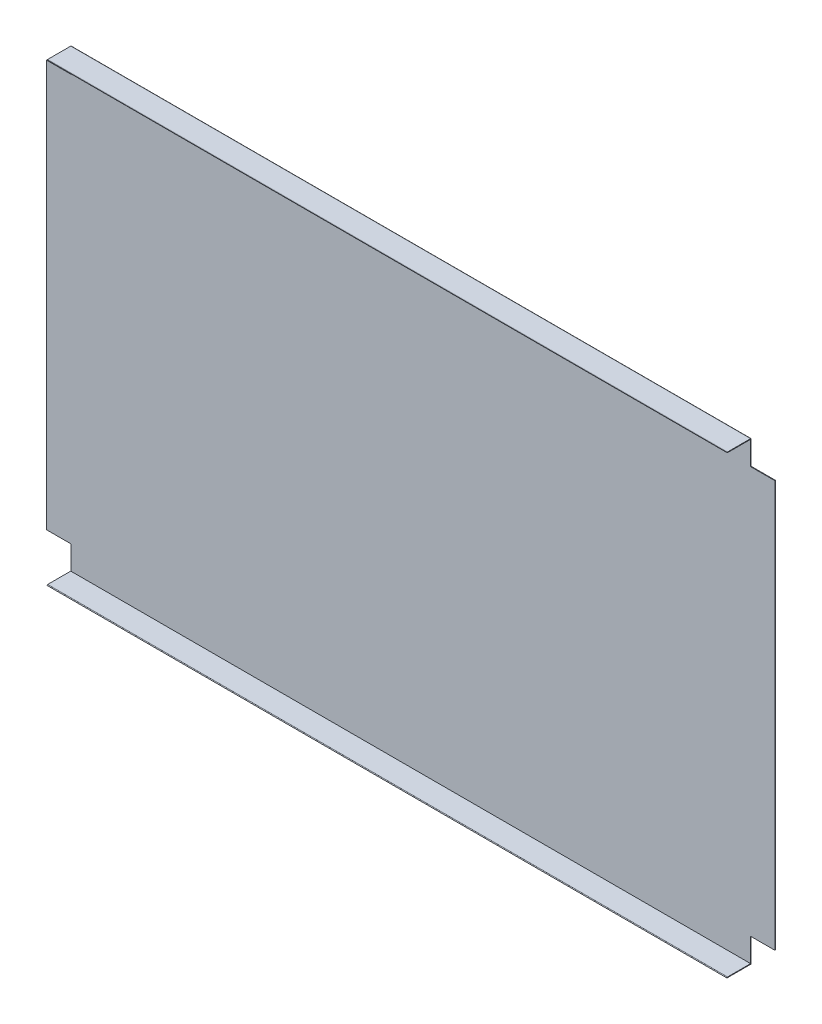
ISO-10303-21;
HEADER;
FILE_DESCRIPTION(('STEP AP214'),'2;1');
FILE_NAME('part.step','',(''),(''),'','','');
FILE_SCHEMA(('AUTOMOTIVE_DESIGN { 1 0 10303 214 1 1 1 1 }'));
ENDSEC;
DATA;
#1=APPLICATION_CONTEXT('core data for automotive mechanical design processes');
#2=APPLICATION_PROTOCOL_DEFINITION('international standard','automotive_design',2000,#1);
#3=PRODUCT_CONTEXT('',#1,'mechanical');
#4=PRODUCT('Part','Part','',(#3));
#5=PRODUCT_RELATED_PRODUCT_CATEGORY('part','',(#4));
#6=PRODUCT_DEFINITION_FORMATION('','',#4);
#7=PRODUCT_DEFINITION_CONTEXT('part definition',#1,'design');
#8=PRODUCT_DEFINITION('design','',#6,#7);
#9=PRODUCT_DEFINITION_SHAPE('','',#8);
#10=(LENGTH_UNIT() NAMED_UNIT(*) SI_UNIT(.MILLI.,.METRE.));
#11=(NAMED_UNIT(*) PLANE_ANGLE_UNIT() SI_UNIT($,.RADIAN.));
#12=(NAMED_UNIT(*) SI_UNIT($,.STERADIAN.) SOLID_ANGLE_UNIT());
#13=UNCERTAINTY_MEASURE_WITH_UNIT(LENGTH_MEASURE(1.E-05),#10,'distance_accuracy_value','');
#14=(GEOMETRIC_REPRESENTATION_CONTEXT(3) GLOBAL_UNCERTAINTY_ASSIGNED_CONTEXT((#13)) GLOBAL_UNIT_ASSIGNED_CONTEXT((#10,
#11,#12)) REPRESENTATION_CONTEXT('',''));
#15=CARTESIAN_POINT('',(0.,0.,0.));
#16=DIRECTION('',(0.,0.,1.));
#17=DIRECTION('',(1.,0.,0.));
#18=AXIS2_PLACEMENT_3D('',#15,#16,#17);
#19=CARTESIAN_POINT('',(559.999999999999,375.,659.000000000004));
#20=DIRECTION('',(-1.,0.,0.));
#21=DIRECTION('',(0.,0.,1.));
#22=AXIS2_PLACEMENT_3D('',#19,#20,#21);
#23=PLANE('',#22);
#24=DIRECTION('',(0.,1.,0.));
#25=VECTOR('',#24,1.);
#26=CARTESIAN_POINT('',(559.999999999999,374.,697.000000000004));
#27=LINE('',#26,#25);
#28=CARTESIAN_POINT('',(559.999999999999,374.,697.000000000004));
#29=VERTEX_POINT('',#28);
#30=CARTESIAN_POINT('',(559.999999999999,375.,697.000000000004));
#31=VERTEX_POINT('',#30);
#32=EDGE_CURVE('E387',#29,#31,#27,.T.);
#33=ORIENTED_EDGE('',*,*,#32,.F.);
#34=DIRECTION('',(0.,0.,1.));
#35=VECTOR('',#34,1.);
#36=CARTESIAN_POINT('',(559.999999999999,374.,659.000000000004));
#37=LINE('',#36,#35);
#38=CARTESIAN_POINT('',(559.999999999999,374.,659.000000000004));
#39=VERTEX_POINT('',#38);
#40=EDGE_CURVE('E346',#29,#39,#37,.F.);
#41=ORIENTED_EDGE('',*,*,#40,.T.);
#42=DIRECTION('',(0.,-1.,0.));
#43=VECTOR('',#42,1.);
#44=CARTESIAN_POINT('',(559.999999999999,375.,659.000000000004));
#45=LINE('',#44,#43);
#46=CARTESIAN_POINT('',(559.999999999999,375.,659.000000000004));
#47=VERTEX_POINT('',#46);
#48=EDGE_CURVE('E363',#47,#39,#45,.T.);
#49=ORIENTED_EDGE('',*,*,#48,.F.);
#50=DIRECTION('',(0.,0.,-1.));
#51=VECTOR('',#50,1.);
#52=CARTESIAN_POINT('',(559.999999999999,374.999999999998,-1.07101362040149E-12));
#53=LINE('',#52,#51);
#54=EDGE_CURVE('E354',#31,#47,#53,.T.);
#55=ORIENTED_EDGE('',*,*,#54,.F.);
#56=EDGE_LOOP('',(#33,#41,#49,#55));
#57=FACE_BOUND('',#56,.T.);
#58=ADVANCED_FACE('F160',(#57),#23,.F.);
#59=CARTESIAN_POINT('',(-560.,375.,698.000000000004));
#60=DIRECTION('',(1.,0.,0.));
#61=DIRECTION('',(0.,0.,-1.));
#62=AXIS2_PLACEMENT_3D('',#59,#60,#61);
#63=PLANE('',#62);
#64=DIRECTION('',(0.,1.,0.));
#65=VECTOR('',#64,1.);
#66=CARTESIAN_POINT('',(-560.,374.,697.000000000004));
#67=LINE('',#66,#65);
#68=CARTESIAN_POINT('',(-560.,374.,697.000000000004));
#69=VERTEX_POINT('',#68);
#70=CARTESIAN_POINT('',(-560.,375.,697.000000000004));
#71=VERTEX_POINT('',#70);
#72=EDGE_CURVE('E348',#69,#71,#67,.T.);
#73=ORIENTED_EDGE('',*,*,#72,.T.);
#74=DIRECTION('',(0.,0.,1.));
#75=VECTOR('',#74,1.);
#76=CARTESIAN_POINT('',(-560.,374.999999999998,-1.07101362040149E-12));
#77=LINE('',#76,#75);
#78=CARTESIAN_POINT('',(-560.,375.,659.000000000004));
#79=VERTEX_POINT('',#78);
#80=EDGE_CURVE('E358',#79,#71,#77,.T.);
#81=ORIENTED_EDGE('',*,*,#80,.F.);
#82=DIRECTION('',(0.,-1.,0.));
#83=VECTOR('',#82,1.);
#84=CARTESIAN_POINT('',(-560.,375.,659.000000000004));
#85=LINE('',#84,#83);
#86=CARTESIAN_POINT('',(-560.,374.,659.000000000004));
#87=VERTEX_POINT('',#86);
#88=EDGE_CURVE('E332',#79,#87,#85,.T.);
#89=ORIENTED_EDGE('',*,*,#88,.T.);
#90=DIRECTION('',(0.,0.,-1.));
#91=VECTOR('',#90,1.);
#92=CARTESIAN_POINT('',(-560.,374.,698.000000000004));
#93=LINE('',#92,#91);
#94=EDGE_CURVE('E352',#87,#69,#93,.F.);
#95=ORIENTED_EDGE('',*,*,#94,.T.);
#96=EDGE_LOOP('',(#73,#81,#89,#95));
#97=FACE_BOUND('',#96,.T.);
#98=ADVANCED_FACE('F418',(#97),#63,.F.);
#99=CARTESIAN_POINT('',(0.,374.999999999998,-1.07101362040149E-12));
#100=DIRECTION('',(0.,-1.,0.));
#101=DIRECTION('',(0.,0.,-1.));
#102=AXIS2_PLACEMENT_3D('',#99,#100,#101);
#103=PLANE('',#102);
#104=DIRECTION('',(-1.,0.,0.));
#105=VECTOR('',#104,1.);
#106=CARTESIAN_POINT('',(-560.,375.,697.000000000004));
#107=LINE('',#106,#105);
#108=EDGE_CURVE('E197',#71,#31,#107,.F.);
#109=ORIENTED_EDGE('',*,*,#108,.T.);
#110=ORIENTED_EDGE('',*,*,#54,.T.);
#111=DIRECTION('',(-1.,0.,0.));
#112=VECTOR('',#111,1.);
#113=CARTESIAN_POINT('',(0.,375.,659.000000000004));
#114=LINE('',#113,#112);
#115=EDGE_CURVE('E356',#47,#79,#114,.T.);
#116=ORIENTED_EDGE('',*,*,#115,.T.);
#117=ORIENTED_EDGE('',*,*,#80,.T.);
#118=EDGE_LOOP('',(#109,#110,#116,#117));
#119=FACE_BOUND('',#118,.T.);
#120=ADVANCED_FACE('F424',(#119),#103,.F.);
#121=CARTESIAN_POINT('',(0.,373.999999999998,-1.06752213906264E-12));
#122=DIRECTION('',(0.,-1.,0.));
#123=DIRECTION('',(0.,0.,-1.));
#124=AXIS2_PLACEMENT_3D('',#121,#122,#123);
#125=PLANE('',#124);
#126=ORIENTED_EDGE('',*,*,#40,.F.);
#127=DIRECTION('',(1.,0.,0.));
#128=VECTOR('',#127,1.);
#129=CARTESIAN_POINT('',(0.,374.,697.000000000004));
#130=LINE('',#129,#128);
#131=EDGE_CURVE('E392',#69,#29,#130,.T.);
#132=ORIENTED_EDGE('',*,*,#131,.F.);
#133=ORIENTED_EDGE('',*,*,#94,.F.);
#134=DIRECTION('',(1.,0.,0.));
#135=VECTOR('',#134,1.);
#136=CARTESIAN_POINT('',(559.999999999999,374.,659.000000000004));
#137=LINE('',#136,#135);
#138=EDGE_CURVE('E349',#39,#87,#137,.F.);
#139=ORIENTED_EDGE('',*,*,#138,.F.);
#140=EDGE_LOOP('',(#126,#132,#133,#139));
#141=FACE_BOUND('',#140,.T.);
#142=ADVANCED_FACE('F432',(#141),#125,.T.);
#143=CARTESIAN_POINT('',(-560.,-375.,659.000000000004));
#144=DIRECTION('',(1.,0.,0.));
#145=DIRECTION('',(0.,0.,-1.));
#146=AXIS2_PLACEMENT_3D('',#143,#144,#145);
#147=PLANE('',#146);
#148=DIRECTION('',(0.,-1.,0.));
#149=VECTOR('',#148,1.);
#150=CARTESIAN_POINT('',(-560.,-374.,697.000000000004));
#151=LINE('',#150,#149);
#152=CARTESIAN_POINT('',(-560.,-374.,697.000000000004));
#153=VERTEX_POINT('',#152);
#154=CARTESIAN_POINT('',(-560.,-375.,697.000000000004));
#155=VERTEX_POINT('',#154);
#156=EDGE_CURVE('E366',#153,#155,#151,.T.);
#157=ORIENTED_EDGE('',*,*,#156,.F.);
#158=DIRECTION('',(0.,0.,1.));
#159=VECTOR('',#158,1.);
#160=CARTESIAN_POINT('',(-560.,-374.,659.000000000004));
#161=LINE('',#160,#159);
#162=CARTESIAN_POINT('',(-560.,-374.,659.000000000004));
#163=VERTEX_POINT('',#162);
#164=EDGE_CURVE('E361',#153,#163,#161,.F.);
#165=ORIENTED_EDGE('',*,*,#164,.T.);
#166=DIRECTION('',(0.,1.,0.));
#167=VECTOR('',#166,1.);
#168=CARTESIAN_POINT('',(-560.,-375.,659.000000000004));
#169=LINE('',#168,#167);
#170=CARTESIAN_POINT('',(-560.,-375.,659.000000000004));
#171=VERTEX_POINT('',#170);
#172=EDGE_CURVE('E314',#171,#163,#169,.T.);
#173=ORIENTED_EDGE('',*,*,#172,.F.);
#174=DIRECTION('',(0.,0.,-1.));
#175=VECTOR('',#174,1.);
#176=CARTESIAN_POINT('',(-560.,-374.999999999998,-1.07101362040149E-12));
#177=LINE('',#176,#175);
#178=EDGE_CURVE('E380',#155,#171,#177,.T.);
#179=ORIENTED_EDGE('',*,*,#178,.F.);
#180=EDGE_LOOP('',(#157,#165,#173,#179));
#181=FACE_BOUND('',#180,.T.);
#182=ADVANCED_FACE('F435',(#181),#147,.F.);
#183=CARTESIAN_POINT('',(560.,-375.,698.000000000004));
#184=DIRECTION('',(-1.,0.,0.));
#185=DIRECTION('',(0.,0.,1.));
#186=AXIS2_PLACEMENT_3D('',#183,#184,#185);
#187=PLANE('',#186);
#188=DIRECTION('',(0.,-1.,0.));
#189=VECTOR('',#188,1.);
#190=CARTESIAN_POINT('',(560.,-374.,697.000000000004));
#191=LINE('',#190,#189);
#192=CARTESIAN_POINT('',(560.,-374.,697.000000000004));
#193=VERTEX_POINT('',#192);
#194=CARTESIAN_POINT('',(560.,-375.,697.000000000004));
#195=VERTEX_POINT('',#194);
#196=EDGE_CURVE('E374',#193,#195,#191,.T.);
#197=ORIENTED_EDGE('',*,*,#196,.T.);
#198=DIRECTION('',(0.,0.,1.));
#199=VECTOR('',#198,1.);
#200=CARTESIAN_POINT('',(560.,-374.999999999998,-1.07101362040149E-12));
#201=LINE('',#200,#199);
#202=CARTESIAN_POINT('',(560.,-375.,659.000000000004));
#203=VERTEX_POINT('',#202);
#204=EDGE_CURVE('E351',#203,#195,#201,.T.);
#205=ORIENTED_EDGE('',*,*,#204,.F.);
#206=DIRECTION('',(0.,1.,0.));
#207=VECTOR('',#206,1.);
#208=CARTESIAN_POINT('',(560.,-375.,659.000000000004));
#209=LINE('',#208,#207);
#210=CARTESIAN_POINT('',(560.,-374.,659.000000000004));
#211=VERTEX_POINT('',#210);
#212=EDGE_CURVE('E376',#203,#211,#209,.T.);
#213=ORIENTED_EDGE('',*,*,#212,.T.);
#214=DIRECTION('',(0.,0.,-1.));
#215=VECTOR('',#214,1.);
#216=CARTESIAN_POINT('',(560.,-374.,698.000000000004));
#217=LINE('',#216,#215);
#218=EDGE_CURVE('E381',#211,#193,#217,.F.);
#219=ORIENTED_EDGE('',*,*,#218,.T.);
#220=EDGE_LOOP('',(#197,#205,#213,#219));
#221=FACE_BOUND('',#220,.T.);
#222=ADVANCED_FACE('F758',(#221),#187,.F.);
#223=CARTESIAN_POINT('',(0.,-374.999999999998,-1.07101362040149E-12));
#224=DIRECTION('',(0.,1.,0.));
#225=DIRECTION('',(0.,0.,1.));
#226=AXIS2_PLACEMENT_3D('',#223,#224,#225);
#227=PLANE('',#226);
#228=DIRECTION('',(1.,0.,0.));
#229=VECTOR('',#228,1.);
#230=CARTESIAN_POINT('',(560.,-375.,697.000000000004));
#231=LINE('',#230,#229);
#232=EDGE_CURVE('E216',#195,#155,#231,.F.);
#233=ORIENTED_EDGE('',*,*,#232,.T.);
#234=ORIENTED_EDGE('',*,*,#178,.T.);
#235=DIRECTION('',(1.,0.,0.));
#236=VECTOR('',#235,1.);
#237=CARTESIAN_POINT('',(0.,-375.,659.000000000004));
#238=LINE('',#237,#236);
#239=EDGE_CURVE('E893',#171,#203,#238,.T.);
#240=ORIENTED_EDGE('',*,*,#239,.T.);
#241=ORIENTED_EDGE('',*,*,#204,.T.);
#242=EDGE_LOOP('',(#233,#234,#240,#241));
#243=FACE_BOUND('',#242,.T.);
#244=ADVANCED_FACE('F746',(#243),#227,.F.);
#245=CARTESIAN_POINT('',(0.,-373.999999999998,-1.06752213906264E-12));
#246=DIRECTION('',(0.,1.,0.));
#247=DIRECTION('',(0.,0.,1.));
#248=AXIS2_PLACEMENT_3D('',#245,#246,#247);
#249=PLANE('',#248);
#250=ORIENTED_EDGE('',*,*,#164,.F.);
#251=DIRECTION('',(-1.,0.,0.));
#252=VECTOR('',#251,1.);
#253=CARTESIAN_POINT('',(0.,-374.,697.000000000004));
#254=LINE('',#253,#252);
#255=EDGE_CURVE('E370',#193,#153,#254,.T.);
#256=ORIENTED_EDGE('',*,*,#255,.F.);
#257=ORIENTED_EDGE('',*,*,#218,.F.);
#258=DIRECTION('',(-1.,0.,0.));
#259=VECTOR('',#258,1.);
#260=CARTESIAN_POINT('',(-560.,-374.,659.000000000004));
#261=LINE('',#260,#259);
#262=EDGE_CURVE('E885',#163,#211,#261,.F.);
#263=ORIENTED_EDGE('',*,*,#262,.F.);
#264=EDGE_LOOP('',(#250,#256,#257,#263));
#265=FACE_BOUND('',#264,.T.);
#266=ADVANCED_FACE('F735',(#265),#249,.T.);
#267=CARTESIAN_POINT('',(0.,0.,658.000000000004));
#268=DIRECTION('',(0.,0.,-1.));
#269=DIRECTION('',(-1.,0.,0.));
#270=AXIS2_PLACEMENT_3D('',#267,#268,#269);
#271=PLANE('',#270);
#272=DIRECTION('',(0.,-1.,0.));
#273=VECTOR('',#272,1.);
#274=CARTESIAN_POINT('',(-559.999999999999,335.,658.000000000004));
#275=LINE('',#274,#273);
#276=CARTESIAN_POINT('',(-560.,374.,658.000000000004));
#277=VERTEX_POINT('',#276);
#278=CARTESIAN_POINT('',(-559.999999999999,335.,658.000000000004));
#279=VERTEX_POINT('',#278);
#280=EDGE_CURVE('E306',#277,#279,#275,.T.);
#281=ORIENTED_EDGE('',*,*,#280,.F.);
#282=DIRECTION('',(-1.,0.,0.));
#283=VECTOR('',#282,1.);
#284=CARTESIAN_POINT('',(0.,374.,658.000000000004));
#285=LINE('',#284,#283);
#286=CARTESIAN_POINT('',(559.999999999999,374.,658.000000000004));
#287=VERTEX_POINT('',#286);
#288=EDGE_CURVE('E313',#287,#277,#285,.T.);
#289=ORIENTED_EDGE('',*,*,#288,.F.);
#290=DIRECTION('',(0.,1.,0.));
#291=VECTOR('',#290,1.);
#292=CARTESIAN_POINT('',(559.999999999999,375.,658.000000000004));
#293=LINE('',#292,#291);
#294=CARTESIAN_POINT('',(559.999999999999,335.,658.000000000004));
#295=VERTEX_POINT('',#294);
#296=EDGE_CURVE('E910',#295,#287,#293,.T.);
#297=ORIENTED_EDGE('',*,*,#296,.F.);
#298=DIRECTION('',(-1.,0.,0.));
#299=VECTOR('',#298,1.);
#300=CARTESIAN_POINT('',(559.999999999999,335.,658.000000000004));
#301=LINE('',#300,#299);
#302=CARTESIAN_POINT('',(600.,335.,658.000000000004));
#303=VERTEX_POINT('',#302);
#304=EDGE_CURVE('E942',#303,#295,#301,.T.);
#305=ORIENTED_EDGE('',*,*,#304,.F.);
#306=DIRECTION('',(0.,1.,0.));
#307=VECTOR('',#306,1.);
#308=CARTESIAN_POINT('',(600.,335.,658.000000000004));
#309=LINE('',#308,#307);
#310=CARTESIAN_POINT('',(600.,-335.,658.000000000004));
#311=VERTEX_POINT('',#310);
#312=EDGE_CURVE('E945',#311,#303,#309,.T.);
#313=ORIENTED_EDGE('',*,*,#312,.F.);
#314=DIRECTION('',(1.,0.,0.));
#315=VECTOR('',#314,1.);
#316=CARTESIAN_POINT('',(600.,-335.,658.000000000004));
#317=LINE('',#316,#315);
#318=CARTESIAN_POINT('',(560.,-335.,658.000000000004));
#319=VERTEX_POINT('',#318);
#320=EDGE_CURVE('E949',#319,#311,#317,.T.);
#321=ORIENTED_EDGE('',*,*,#320,.F.);
#322=DIRECTION('',(0.,1.,0.));
#323=VECTOR('',#322,1.);
#324=CARTESIAN_POINT('',(560.,-335.,658.000000000004));
#325=LINE('',#324,#323);
#326=CARTESIAN_POINT('',(560.,-374.,658.000000000004));
#327=VERTEX_POINT('',#326);
#328=EDGE_CURVE('E953',#327,#319,#325,.T.);
#329=ORIENTED_EDGE('',*,*,#328,.F.);
#330=DIRECTION('',(1.,0.,0.));
#331=VECTOR('',#330,1.);
#332=CARTESIAN_POINT('',(0.,-374.,658.000000000004));
#333=LINE('',#332,#331);
#334=CARTESIAN_POINT('',(-560.,-374.,658.000000000004));
#335=VERTEX_POINT('',#334);
#336=EDGE_CURVE('E970',#335,#327,#333,.T.);
#337=ORIENTED_EDGE('',*,*,#336,.F.);
#338=DIRECTION('',(0.,-1.,0.));
#339=VECTOR('',#338,1.);
#340=CARTESIAN_POINT('',(-560.,-375.,658.000000000004));
#341=LINE('',#340,#339);
#342=CARTESIAN_POINT('',(-560.,-335.,658.000000000004));
#343=VERTEX_POINT('',#342);
#344=EDGE_CURVE('E955',#343,#335,#341,.T.);
#345=ORIENTED_EDGE('',*,*,#344,.F.);
#346=DIRECTION('',(1.,0.,0.));
#347=VECTOR('',#346,1.);
#348=CARTESIAN_POINT('',(-560.,-335.,658.000000000004));
#349=LINE('',#348,#347);
#350=CARTESIAN_POINT('',(-600.,-335.,658.000000000004));
#351=VERTEX_POINT('',#350);
#352=EDGE_CURVE('E957',#351,#343,#349,.T.);
#353=ORIENTED_EDGE('',*,*,#352,.F.);
#354=DIRECTION('',(0.,-1.,0.));
#355=VECTOR('',#354,1.);
#356=CARTESIAN_POINT('',(-600.,-335.,658.000000000004));
#357=LINE('',#356,#355);
#358=CARTESIAN_POINT('',(-600.,335.,658.000000000004));
#359=VERTEX_POINT('',#358);
#360=EDGE_CURVE('E962',#359,#351,#357,.T.);
#361=ORIENTED_EDGE('',*,*,#360,.F.);
#362=DIRECTION('',(-1.,0.,0.));
#363=VECTOR('',#362,1.);
#364=CARTESIAN_POINT('',(-600.,335.,658.000000000004));
#365=LINE('',#364,#363);
#366=EDGE_CURVE('E325',#279,#359,#365,.T.);
#367=ORIENTED_EDGE('',*,*,#366,.F.);
#368=EDGE_LOOP('',(#281,#289,#297,#305,#313,#321,#329,#337,#345,#353,#361,#367));
#369=FACE_BOUND('',#368,.T.);
#370=ADVANCED_FACE('F319',(#369),#271,.T.);
#371=CARTESIAN_POINT('',(0.,0.,659.000000000004));
#372=DIRECTION('',(0.,0.,-1.));
#373=DIRECTION('',(-1.,0.,0.));
#374=AXIS2_PLACEMENT_3D('',#371,#372,#373);
#375=PLANE('',#374);
#376=ORIENTED_EDGE('',*,*,#138,.T.);
#377=DIRECTION('',(0.,-1.,0.));
#378=VECTOR('',#377,1.);
#379=CARTESIAN_POINT('',(-559.999999999999,335.,659.000000000004));
#380=LINE('',#379,#378);
#381=CARTESIAN_POINT('',(-559.999999999999,335.,659.000000000004));
#382=VERTEX_POINT('',#381);
#383=EDGE_CURVE('E308',#87,#382,#380,.T.);
#384=ORIENTED_EDGE('',*,*,#383,.T.);
#385=DIRECTION('',(-1.,0.,0.));
#386=VECTOR('',#385,1.);
#387=CARTESIAN_POINT('',(-600.,335.,659.000000000004));
#388=LINE('',#387,#386);
#389=CARTESIAN_POINT('',(-600.,335.,659.000000000004));
#390=VERTEX_POINT('',#389);
#391=EDGE_CURVE('E937',#382,#390,#388,.T.);
#392=ORIENTED_EDGE('',*,*,#391,.T.);
#393=DIRECTION('',(0.,-1.,0.));
#394=VECTOR('',#393,1.);
#395=CARTESIAN_POINT('',(-600.,-335.,659.000000000004));
#396=LINE('',#395,#394);
#397=CARTESIAN_POINT('',(-600.,-335.,659.000000000004));
#398=VERTEX_POINT('',#397);
#399=EDGE_CURVE('E934',#390,#398,#396,.T.);
#400=ORIENTED_EDGE('',*,*,#399,.T.);
#401=DIRECTION('',(1.,0.,0.));
#402=VECTOR('',#401,1.);
#403=CARTESIAN_POINT('',(-560.,-335.,659.000000000004));
#404=LINE('',#403,#402);
#405=CARTESIAN_POINT('',(-560.,-335.,659.000000000004));
#406=VERTEX_POINT('',#405);
#407=EDGE_CURVE('E931',#398,#406,#404,.T.);
#408=ORIENTED_EDGE('',*,*,#407,.T.);
#409=DIRECTION('',(0.,-1.,0.));
#410=VECTOR('',#409,1.);
#411=CARTESIAN_POINT('',(-560.,-375.,659.000000000004));
#412=LINE('',#411,#410);
#413=EDGE_CURVE('E929',#406,#163,#412,.T.);
#414=ORIENTED_EDGE('',*,*,#413,.T.);
#415=ORIENTED_EDGE('',*,*,#262,.T.);
#416=DIRECTION('',(0.,1.,0.));
#417=VECTOR('',#416,1.);
#418=CARTESIAN_POINT('',(560.,-335.,659.000000000004));
#419=LINE('',#418,#417);
#420=CARTESIAN_POINT('',(560.,-335.,659.000000000004));
#421=VERTEX_POINT('',#420);
#422=EDGE_CURVE('E927',#211,#421,#419,.T.);
#423=ORIENTED_EDGE('',*,*,#422,.T.);
#424=DIRECTION('',(1.,0.,0.));
#425=VECTOR('',#424,1.);
#426=CARTESIAN_POINT('',(600.,-335.,659.000000000004));
#427=LINE('',#426,#425);
#428=CARTESIAN_POINT('',(600.,-335.,659.000000000004));
#429=VERTEX_POINT('',#428);
#430=EDGE_CURVE('E924',#421,#429,#427,.T.);
#431=ORIENTED_EDGE('',*,*,#430,.T.);
#432=DIRECTION('',(0.,1.,0.));
#433=VECTOR('',#432,1.);
#434=CARTESIAN_POINT('',(600.,335.,659.000000000004));
#435=LINE('',#434,#433);
#436=CARTESIAN_POINT('',(600.,335.,659.000000000004));
#437=VERTEX_POINT('',#436);
#438=EDGE_CURVE('E917',#429,#437,#435,.T.);
#439=ORIENTED_EDGE('',*,*,#438,.T.);
#440=DIRECTION('',(-1.,0.,0.));
#441=VECTOR('',#440,1.);
#442=CARTESIAN_POINT('',(559.999999999999,335.,659.000000000004));
#443=LINE('',#442,#441);
#444=CARTESIAN_POINT('',(559.999999999999,335.,659.000000000004));
#445=VERTEX_POINT('',#444);
#446=EDGE_CURVE('E915',#437,#445,#443,.T.);
#447=ORIENTED_EDGE('',*,*,#446,.T.);
#448=DIRECTION('',(0.,1.,0.));
#449=VECTOR('',#448,1.);
#450=CARTESIAN_POINT('',(559.999999999999,375.,659.000000000004));
#451=LINE('',#450,#449);
#452=EDGE_CURVE('E327',#445,#39,#451,.T.);
#453=ORIENTED_EDGE('',*,*,#452,.T.);
#454=EDGE_LOOP('',(#376,#384,#392,#400,#408,#414,#415,#423,#431,#439,#447,#453));
#455=FACE_BOUND('',#454,.T.);
#456=ADVANCED_FACE('F713',(#455),#375,.F.);
#457=CARTESIAN_POINT('',(-559.999999999999,335.,658.000000000004));
#458=DIRECTION('',(-1.,0.,0.));
#459=DIRECTION('',(0.,-1.,0.));
#460=AXIS2_PLACEMENT_3D('',#457,#458,#459);
#461=PLANE('',#460);
#462=ORIENTED_EDGE('',*,*,#383,.F.);
#463=DIRECTION('',(0.,0.,1.));
#464=VECTOR('',#463,1.);
#465=CARTESIAN_POINT('',(-560.,374.,658.000000000004));
#466=LINE('',#465,#464);
#467=EDGE_CURVE('E302',#277,#87,#466,.T.);
#468=ORIENTED_EDGE('',*,*,#467,.F.);
#469=ORIENTED_EDGE('',*,*,#280,.T.);
#470=DIRECTION('',(0.,0.,1.));
#471=VECTOR('',#470,1.);
#472=CARTESIAN_POINT('',(-559.999999999999,335.,658.000000000004));
#473=LINE('',#472,#471);
#474=EDGE_CURVE('E326',#279,#382,#473,.T.);
#475=ORIENTED_EDGE('',*,*,#474,.T.);
#476=EDGE_LOOP('',(#462,#468,#469,#475));
#477=FACE_BOUND('',#476,.T.);
#478=ADVANCED_FACE('F304',(#477),#461,.T.);
#479=CARTESIAN_POINT('',(560.,-335.,658.000000000004));
#480=DIRECTION('',(1.,0.,0.));
#481=DIRECTION('',(0.,0.,-1.));
#482=AXIS2_PLACEMENT_3D('',#479,#480,#481);
#483=PLANE('',#482);
#484=ORIENTED_EDGE('',*,*,#422,.F.);
#485=DIRECTION('',(0.,0.,1.));
#486=VECTOR('',#485,1.);
#487=CARTESIAN_POINT('',(560.,-374.,658.000000000004));
#488=LINE('',#487,#486);
#489=EDGE_CURVE('E977',#327,#211,#488,.T.);
#490=ORIENTED_EDGE('',*,*,#489,.F.);
#491=ORIENTED_EDGE('',*,*,#328,.T.);
#492=DIRECTION('',(0.,0.,1.));
#493=VECTOR('',#492,1.);
#494=CARTESIAN_POINT('',(560.,-335.,658.000000000004));
#495=LINE('',#494,#493);
#496=EDGE_CURVE('E911',#319,#421,#495,.T.);
#497=ORIENTED_EDGE('',*,*,#496,.T.);
#498=EDGE_LOOP('',(#484,#490,#491,#497));
#499=FACE_BOUND('',#498,.T.);
#500=ADVANCED_FACE('F690',(#499),#483,.T.);
#501=CARTESIAN_POINT('',(559.999999999999,375.,658.000000000004));
#502=DIRECTION('',(1.,0.,0.));
#503=DIRECTION('',(0.,0.,-1.));
#504=AXIS2_PLACEMENT_3D('',#501,#502,#503);
#505=PLANE('',#504);
#506=DIRECTION('',(0.,0.,1.));
#507=VECTOR('',#506,1.);
#508=CARTESIAN_POINT('',(559.999999999999,374.,658.000000000004));
#509=LINE('',#508,#507);
#510=EDGE_CURVE('E343',#287,#39,#509,.T.);
#511=ORIENTED_EDGE('',*,*,#510,.T.);
#512=ORIENTED_EDGE('',*,*,#452,.F.);
#513=DIRECTION('',(0.,0.,1.));
#514=VECTOR('',#513,1.);
#515=CARTESIAN_POINT('',(559.999999999999,335.,658.000000000004));
#516=LINE('',#515,#514);
#517=EDGE_CURVE('E920',#295,#445,#516,.T.);
#518=ORIENTED_EDGE('',*,*,#517,.F.);
#519=ORIENTED_EDGE('',*,*,#296,.T.);
#520=EDGE_LOOP('',(#511,#512,#518,#519));
#521=FACE_BOUND('',#520,.T.);
#522=ADVANCED_FACE('F678',(#521),#505,.T.);
#523=CARTESIAN_POINT('',(559.999999999999,335.,658.000000000004));
#524=DIRECTION('',(0.,1.,0.));
#525=DIRECTION('',(0.,0.,1.));
#526=AXIS2_PLACEMENT_3D('',#523,#524,#525);
#527=PLANE('',#526);
#528=ORIENTED_EDGE('',*,*,#446,.F.);
#529=DIRECTION('',(0.,0.,1.));
#530=VECTOR('',#529,1.);
#531=CARTESIAN_POINT('',(600.,335.,658.000000000004));
#532=LINE('',#531,#530);
#533=EDGE_CURVE('E948',#303,#437,#532,.T.);
#534=ORIENTED_EDGE('',*,*,#533,.F.);
#535=ORIENTED_EDGE('',*,*,#304,.T.);
#536=ORIENTED_EDGE('',*,*,#517,.T.);
#537=EDGE_LOOP('',(#528,#534,#535,#536));
#538=FACE_BOUND('',#537,.T.);
#539=ADVANCED_FACE('F666',(#538),#527,.T.);
#540=CARTESIAN_POINT('',(600.,335.,658.000000000004));
#541=DIRECTION('',(1.,0.,0.));
#542=DIRECTION('',(0.,1.,0.));
#543=AXIS2_PLACEMENT_3D('',#540,#541,#542);
#544=PLANE('',#543);
#545=ORIENTED_EDGE('',*,*,#438,.F.);
#546=DIRECTION('',(0.,0.,1.));
#547=VECTOR('',#546,1.);
#548=CARTESIAN_POINT('',(600.,-335.,658.000000000004));
#549=LINE('',#548,#547);
#550=EDGE_CURVE('E952',#311,#429,#549,.T.);
#551=ORIENTED_EDGE('',*,*,#550,.F.);
#552=ORIENTED_EDGE('',*,*,#312,.T.);
#553=ORIENTED_EDGE('',*,*,#533,.T.);
#554=EDGE_LOOP('',(#545,#551,#552,#553));
#555=FACE_BOUND('',#554,.T.);
#556=ADVANCED_FACE('F654',(#555),#544,.T.);
#557=CARTESIAN_POINT('',(600.,-335.,658.000000000004));
#558=DIRECTION('',(0.,-1.,0.));
#559=DIRECTION('',(0.,0.,-1.));
#560=AXIS2_PLACEMENT_3D('',#557,#558,#559);
#561=PLANE('',#560);
#562=ORIENTED_EDGE('',*,*,#430,.F.);
#563=ORIENTED_EDGE('',*,*,#496,.F.);
#564=ORIENTED_EDGE('',*,*,#320,.T.);
#565=ORIENTED_EDGE('',*,*,#550,.T.);
#566=EDGE_LOOP('',(#562,#563,#564,#565));
#567=FACE_BOUND('',#566,.T.);
#568=ADVANCED_FACE('F642',(#567),#561,.T.);
#569=CARTESIAN_POINT('',(-560.,-375.,658.000000000004));
#570=DIRECTION('',(-1.,0.,0.));
#571=DIRECTION('',(0.,0.,1.));
#572=AXIS2_PLACEMENT_3D('',#569,#570,#571);
#573=PLANE('',#572);
#574=DIRECTION('',(0.,0.,1.));
#575=VECTOR('',#574,1.);
#576=CARTESIAN_POINT('',(-560.,-374.,658.000000000004));
#577=LINE('',#576,#575);
#578=EDGE_CURVE('E958',#335,#163,#577,.T.);
#579=ORIENTED_EDGE('',*,*,#578,.T.);
#580=ORIENTED_EDGE('',*,*,#413,.F.);
#581=DIRECTION('',(0.,0.,1.));
#582=VECTOR('',#581,1.);
#583=CARTESIAN_POINT('',(-560.,-335.,658.000000000004));
#584=LINE('',#583,#582);
#585=EDGE_CURVE('E961',#343,#406,#584,.T.);
#586=ORIENTED_EDGE('',*,*,#585,.F.);
#587=ORIENTED_EDGE('',*,*,#344,.T.);
#588=EDGE_LOOP('',(#579,#580,#586,#587));
#589=FACE_BOUND('',#588,.T.);
#590=ADVANCED_FACE('F630',(#589),#573,.T.);
#591=CARTESIAN_POINT('',(-560.,-335.,658.000000000004));
#592=DIRECTION('',(0.,-1.,0.));
#593=DIRECTION('',(0.,0.,-1.));
#594=AXIS2_PLACEMENT_3D('',#591,#592,#593);
#595=PLANE('',#594);
#596=ORIENTED_EDGE('',*,*,#407,.F.);
#597=DIRECTION('',(0.,0.,1.));
#598=VECTOR('',#597,1.);
#599=CARTESIAN_POINT('',(-600.,-335.,658.000000000004));
#600=LINE('',#599,#598);
#601=EDGE_CURVE('E965',#351,#398,#600,.T.);
#602=ORIENTED_EDGE('',*,*,#601,.F.);
#603=ORIENTED_EDGE('',*,*,#352,.T.);
#604=ORIENTED_EDGE('',*,*,#585,.T.);
#605=EDGE_LOOP('',(#596,#602,#603,#604));
#606=FACE_BOUND('',#605,.T.);
#607=ADVANCED_FACE('F618',(#606),#595,.T.);
#608=CARTESIAN_POINT('',(-600.,-335.,658.000000000004));
#609=DIRECTION('',(-1.,0.,0.));
#610=DIRECTION('',(0.,-1.,0.));
#611=AXIS2_PLACEMENT_3D('',#608,#609,#610);
#612=PLANE('',#611);
#613=ORIENTED_EDGE('',*,*,#399,.F.);
#614=DIRECTION('',(0.,0.,1.));
#615=VECTOR('',#614,1.);
#616=CARTESIAN_POINT('',(-600.,335.,658.000000000004));
#617=LINE('',#616,#615);
#618=EDGE_CURVE('E966',#359,#390,#617,.T.);
#619=ORIENTED_EDGE('',*,*,#618,.F.);
#620=ORIENTED_EDGE('',*,*,#360,.T.);
#621=ORIENTED_EDGE('',*,*,#601,.T.);
#622=EDGE_LOOP('',(#613,#619,#620,#621));
#623=FACE_BOUND('',#622,.T.);
#624=ADVANCED_FACE('F606',(#623),#612,.T.);
#625=CARTESIAN_POINT('',(-600.,335.,658.000000000004));
#626=DIRECTION('',(0.,1.,0.));
#627=DIRECTION('',(0.,0.,1.));
#628=AXIS2_PLACEMENT_3D('',#625,#626,#627);
#629=PLANE('',#628);
#630=ORIENTED_EDGE('',*,*,#391,.F.);
#631=ORIENTED_EDGE('',*,*,#474,.F.);
#632=ORIENTED_EDGE('',*,*,#366,.T.);
#633=ORIENTED_EDGE('',*,*,#618,.T.);
#634=EDGE_LOOP('',(#630,#631,#632,#633));
#635=FACE_BOUND('',#634,.T.);
#636=ADVANCED_FACE('F594',(#635),#629,.T.);
#637=CARTESIAN_POINT('',(560.,-374.,658.000000000004));
#638=DIRECTION('',(1.,0.,0.));
#639=DIRECTION('',(0.,0.,-1.));
#640=AXIS2_PLACEMENT_3D('',#637,#638,#639);
#641=PLANE('',#640);
#642=CARTESIAN_POINT('',(560.,-374.,659.000000000004));
#643=DIRECTION('',(-1.,0.,0.));
#644=DIRECTION('',(0.,0.,1.));
#645=AXIS2_PLACEMENT_3D('',#642,#643,#644);
#646=CIRCLE('',#645,0.99999999999989);
#647=EDGE_CURVE('E968',#327,#203,#646,.T.);
#648=ORIENTED_EDGE('',*,*,#647,.F.);
#649=ORIENTED_EDGE('',*,*,#489,.T.);
#650=ORIENTED_EDGE('',*,*,#212,.F.);
#651=EDGE_LOOP('',(#648,#649,#650));
#652=FACE_BOUND('',#651,.T.);
#653=ADVANCED_FACE('F582',(#652),#641,.T.);
#654=CARTESIAN_POINT('',(-560.,-374.,659.000000000004));
#655=DIRECTION('',(-1.,0.,0.));
#656=DIRECTION('',(0.,0.,1.));
#657=AXIS2_PLACEMENT_3D('',#654,#655,#656);
#658=CYLINDRICAL_SURFACE('',#657,0.99999999999989);
#659=CARTESIAN_POINT('',(-560.,-374.,659.000000000004));
#660=DIRECTION('',(-1.,0.,0.));
#661=DIRECTION('',(0.,0.,1.));
#662=AXIS2_PLACEMENT_3D('',#659,#660,#661);
#663=CIRCLE('',#662,0.99999999999989);
#664=EDGE_CURVE('E900',#335,#171,#663,.T.);
#665=ORIENTED_EDGE('',*,*,#664,.F.);
#666=ORIENTED_EDGE('',*,*,#336,.T.);
#667=ORIENTED_EDGE('',*,*,#647,.T.);
#668=ORIENTED_EDGE('',*,*,#239,.F.);
#669=EDGE_LOOP('',(#665,#666,#667,#668));
#670=FACE_BOUND('',#669,.T.);
#671=ADVANCED_FACE('F570',(#670),#658,.T.);
#672=CARTESIAN_POINT('',(-560.,-374.,658.000000000004));
#673=DIRECTION('',(1.,0.,0.));
#674=DIRECTION('',(0.,0.,-1.));
#675=AXIS2_PLACEMENT_3D('',#672,#673,#674);
#676=PLANE('',#675);
#677=ORIENTED_EDGE('',*,*,#578,.F.);
#678=ORIENTED_EDGE('',*,*,#664,.T.);
#679=ORIENTED_EDGE('',*,*,#172,.T.);
#680=EDGE_LOOP('',(#677,#678,#679));
#681=FACE_BOUND('',#680,.T.);
#682=ADVANCED_FACE('F559',(#681),#676,.F.);
#683=CARTESIAN_POINT('',(-560.,374.,658.000000000004));
#684=DIRECTION('',(-1.,0.,0.));
#685=DIRECTION('',(0.,0.,1.));
#686=AXIS2_PLACEMENT_3D('',#683,#684,#685);
#687=PLANE('',#686);
#688=CARTESIAN_POINT('',(-560.,374.,659.000000000004));
#689=DIRECTION('',(1.,0.,0.));
#690=DIRECTION('',(0.,0.,-1.));
#691=AXIS2_PLACEMENT_3D('',#688,#689,#690);
#692=CIRCLE('',#691,0.99999999999989);
#693=EDGE_CURVE('E329',#277,#79,#692,.T.);
#694=ORIENTED_EDGE('',*,*,#693,.F.);
#695=ORIENTED_EDGE('',*,*,#467,.T.);
#696=ORIENTED_EDGE('',*,*,#88,.F.);
#697=EDGE_LOOP('',(#694,#695,#696));
#698=FACE_BOUND('',#697,.T.);
#699=ADVANCED_FACE('F330',(#698),#687,.T.);
#700=CARTESIAN_POINT('',(559.999999999999,374.,659.000000000004));
#701=DIRECTION('',(1.,0.,0.));
#702=DIRECTION('',(0.,0.,-1.));
#703=AXIS2_PLACEMENT_3D('',#700,#701,#702);
#704=CYLINDRICAL_SURFACE('',#703,0.99999999999989);
#705=CARTESIAN_POINT('',(559.999999999999,374.,659.000000000004));
#706=DIRECTION('',(1.,0.,0.));
#707=DIRECTION('',(0.,0.,-1.));
#708=AXIS2_PLACEMENT_3D('',#705,#706,#707);
#709=CIRCLE('',#708,0.99999999999989);
#710=EDGE_CURVE('E336',#287,#47,#709,.T.);
#711=ORIENTED_EDGE('',*,*,#710,.F.);
#712=ORIENTED_EDGE('',*,*,#288,.T.);
#713=ORIENTED_EDGE('',*,*,#693,.T.);
#714=ORIENTED_EDGE('',*,*,#115,.F.);
#715=EDGE_LOOP('',(#711,#712,#713,#714));
#716=FACE_BOUND('',#715,.T.);
#717=ADVANCED_FACE('F338',(#716),#704,.T.);
#718=CARTESIAN_POINT('',(559.999999999999,374.,658.000000000004));
#719=DIRECTION('',(-1.,0.,0.));
#720=DIRECTION('',(0.,0.,1.));
#721=AXIS2_PLACEMENT_3D('',#718,#719,#720);
#722=PLANE('',#721);
#723=ORIENTED_EDGE('',*,*,#510,.F.);
#724=ORIENTED_EDGE('',*,*,#710,.T.);
#725=ORIENTED_EDGE('',*,*,#48,.T.);
#726=EDGE_LOOP('',(#723,#724,#725));
#727=FACE_BOUND('',#726,.T.);
#728=ADVANCED_FACE('F429',(#727),#722,.F.);
#729=CARTESIAN_POINT('',(-560.,-374.,697.000000000004));
#730=DIRECTION('',(-1.,0.,0.));
#731=DIRECTION('',(0.,0.,1.));
#732=AXIS2_PLACEMENT_3D('',#729,#730,#731);
#733=PLANE('',#732);
#734=CARTESIAN_POINT('',(-560.,-375.,697.000000000004));
#735=DIRECTION('',(1.,0.,0.));
#736=DIRECTION('',(0.,0.,-1.));
#737=AXIS2_PLACEMENT_3D('',#734,#735,#736);
#738=CIRCLE('',#737,1.00000000000006);
#739=CARTESIAN_POINT('',(-560.,-375.,698.000000000004));
#740=VERTEX_POINT('',#739);
#741=EDGE_CURVE('E367',#153,#740,#738,.T.);
#742=ORIENTED_EDGE('',*,*,#741,.F.);
#743=ORIENTED_EDGE('',*,*,#156,.T.);
#744=DIRECTION('',(0.,0.,-1.));
#745=VECTOR('',#744,1.);
#746=CARTESIAN_POINT('',(-560.,-375.,698.000000000004));
#747=LINE('',#746,#745);
#748=EDGE_CURVE('E170',#740,#155,#747,.T.);
#749=ORIENTED_EDGE('',*,*,#748,.F.);
#750=EDGE_LOOP('',(#742,#743,#749));
#751=FACE_BOUND('',#750,.T.);
#752=ADVANCED_FACE('F440',(#751),#733,.T.);
#753=CARTESIAN_POINT('',(560.,-375.,697.000000000004));
#754=DIRECTION('',(1.,0.,0.));
#755=DIRECTION('',(0.,0.,-1.));
#756=AXIS2_PLACEMENT_3D('',#753,#754,#755);
#757=CYLINDRICAL_SURFACE('',#756,1.00000000000006);
#758=CARTESIAN_POINT('',(560.,-375.,697.000000000004));
#759=DIRECTION('',(1.,0.,0.));
#760=DIRECTION('',(0.,0.,-1.));
#761=AXIS2_PLACEMENT_3D('',#758,#759,#760);
#762=CIRCLE('',#761,1.00000000000006);
#763=CARTESIAN_POINT('',(560.,-375.,698.000000000004));
#764=VERTEX_POINT('',#763);
#765=EDGE_CURVE('E369',#193,#764,#762,.T.);
#766=ORIENTED_EDGE('',*,*,#765,.F.);
#767=ORIENTED_EDGE('',*,*,#255,.T.);
#768=ORIENTED_EDGE('',*,*,#741,.T.);
#769=DIRECTION('',(-1.,0.,0.));
#770=VECTOR('',#769,1.);
#771=CARTESIAN_POINT('',(0.,-375.,698.000000000004));
#772=LINE('',#771,#770);
#773=EDGE_CURVE('E13',#764,#740,#772,.T.);
#774=ORIENTED_EDGE('',*,*,#773,.F.);
#775=EDGE_LOOP('',(#766,#767,#768,#774));
#776=FACE_BOUND('',#775,.T.);
#777=ADVANCED_FACE('F443',(#776),#757,.T.);
#778=CARTESIAN_POINT('',(560.,-374.,697.000000000004));
#779=DIRECTION('',(-1.,0.,0.));
#780=DIRECTION('',(0.,0.,1.));
#781=AXIS2_PLACEMENT_3D('',#778,#779,#780);
#782=PLANE('',#781);
#783=ORIENTED_EDGE('',*,*,#196,.F.);
#784=ORIENTED_EDGE('',*,*,#765,.T.);
#785=DIRECTION('',(0.,0.,-1.));
#786=VECTOR('',#785,1.);
#787=CARTESIAN_POINT('',(560.,-375.,698.000000000004));
#788=LINE('',#787,#786);
#789=EDGE_CURVE('E373',#764,#195,#788,.T.);
#790=ORIENTED_EDGE('',*,*,#789,.T.);
#791=EDGE_LOOP('',(#783,#784,#790));
#792=FACE_BOUND('',#791,.T.);
#793=ADVANCED_FACE('F447',(#792),#782,.F.);
#794=CARTESIAN_POINT('',(559.999999999999,374.,697.000000000004));
#795=DIRECTION('',(1.,0.,0.));
#796=DIRECTION('',(0.,0.,-1.));
#797=AXIS2_PLACEMENT_3D('',#794,#795,#796);
#798=PLANE('',#797);
#799=CARTESIAN_POINT('',(559.999999999999,375.,697.000000000004));
#800=DIRECTION('',(-1.,0.,0.));
#801=DIRECTION('',(0.,0.,1.));
#802=AXIS2_PLACEMENT_3D('',#799,#800,#801);
#803=CIRCLE('',#802,1.00000000000006);
#804=CARTESIAN_POINT('',(559.999999999999,375.,698.000000000004));
#805=VERTEX_POINT('',#804);
#806=EDGE_CURVE('E388',#29,#805,#803,.T.);
#807=ORIENTED_EDGE('',*,*,#806,.F.);
#808=ORIENTED_EDGE('',*,*,#32,.T.);
#809=DIRECTION('',(0.,0.,-1.));
#810=VECTOR('',#809,1.);
#811=CARTESIAN_POINT('',(559.999999999999,375.,698.000000000004));
#812=LINE('',#811,#810);
#813=EDGE_CURVE('E400',#805,#31,#812,.T.);
#814=ORIENTED_EDGE('',*,*,#813,.F.);
#815=EDGE_LOOP('',(#807,#808,#814));
#816=FACE_BOUND('',#815,.T.);
#817=ADVANCED_FACE('F451',(#816),#798,.T.);
#818=CARTESIAN_POINT('',(-560.,375.,697.000000000004));
#819=DIRECTION('',(-1.,0.,0.));
#820=DIRECTION('',(0.,0.,1.));
#821=AXIS2_PLACEMENT_3D('',#818,#819,#820);
#822=CYLINDRICAL_SURFACE('',#821,1.00000000000006);
#823=CARTESIAN_POINT('',(-560.,375.,697.000000000004));
#824=DIRECTION('',(-1.,0.,0.));
#825=DIRECTION('',(0.,0.,1.));
#826=AXIS2_PLACEMENT_3D('',#823,#824,#825);
#827=CIRCLE('',#826,1.00000000000006);
#828=CARTESIAN_POINT('',(-560.,375.,698.000000000004));
#829=VERTEX_POINT('',#828);
#830=EDGE_CURVE('E391',#69,#829,#827,.T.);
#831=ORIENTED_EDGE('',*,*,#830,.F.);
#832=ORIENTED_EDGE('',*,*,#131,.T.);
#833=ORIENTED_EDGE('',*,*,#806,.T.);
#834=DIRECTION('',(1.,0.,0.));
#835=VECTOR('',#834,1.);
#836=CARTESIAN_POINT('',(0.,375.,698.000000000004));
#837=LINE('',#836,#835);
#838=EDGE_CURVE('E384',#829,#805,#837,.T.);
#839=ORIENTED_EDGE('',*,*,#838,.F.);
#840=EDGE_LOOP('',(#831,#832,#833,#839));
#841=FACE_BOUND('',#840,.T.);
#842=ADVANCED_FACE('F408',(#841),#822,.T.);
#843=CARTESIAN_POINT('',(-560.,374.,697.000000000004));
#844=DIRECTION('',(1.,0.,0.));
#845=DIRECTION('',(0.,0.,-1.));
#846=AXIS2_PLACEMENT_3D('',#843,#844,#845);
#847=PLANE('',#846);
#848=ORIENTED_EDGE('',*,*,#72,.F.);
#849=ORIENTED_EDGE('',*,*,#830,.T.);
#850=DIRECTION('',(0.,0.,-1.));
#851=VECTOR('',#850,1.);
#852=CARTESIAN_POINT('',(-560.,375.,698.000000000004));
#853=LINE('',#852,#851);
#854=EDGE_CURVE('E164',#829,#71,#853,.T.);
#855=ORIENTED_EDGE('',*,*,#854,.T.);
#856=EDGE_LOOP('',(#848,#849,#855));
#857=FACE_BOUND('',#856,.T.);
#858=ADVANCED_FACE('F404',(#857),#847,.F.);
#859=CARTESIAN_POINT('',(-560.,375.,698.000000000004));
#860=DIRECTION('',(0.,-1.,0.));
#861=DIRECTION('',(-1.,0.,0.));
#862=AXIS2_PLACEMENT_3D('',#859,#860,#861);
#863=PLANE('',#862);
#864=ORIENTED_EDGE('',*,*,#813,.T.);
#865=ORIENTED_EDGE('',*,*,#108,.F.);
#866=ORIENTED_EDGE('',*,*,#854,.F.);
#867=ORIENTED_EDGE('',*,*,#838,.T.);
#868=EDGE_LOOP('',(#864,#865,#866,#867));
#869=FACE_BOUND('',#868,.T.);
#870=ADVANCED_FACE('F162',(#869),#863,.F.);
#871=CARTESIAN_POINT('',(560.,-375.,698.000000000004));
#872=DIRECTION('',(0.,1.,0.));
#873=DIRECTION('',(1.,0.,0.));
#874=AXIS2_PLACEMENT_3D('',#871,#872,#873);
#875=PLANE('',#874);
#876=ORIENTED_EDGE('',*,*,#748,.T.);
#877=ORIENTED_EDGE('',*,*,#232,.F.);
#878=ORIENTED_EDGE('',*,*,#789,.F.);
#879=ORIENTED_EDGE('',*,*,#773,.T.);
#880=EDGE_LOOP('',(#876,#877,#878,#879));
#881=FACE_BOUND('',#880,.T.);
#882=ADVANCED_FACE('F411',(#881),#875,.F.);
#883=CLOSED_SHELL('',(#58,#98,#120,#142,#182,#222,#244,#266,#370,#456,#478,#500,#522,#539,#556,
#568,#590,#607,#624,#636,#653,#671,#682,#699,#717,#728,#752,#777,#793,#817,#842,#858,#870,#882));
#884=MANIFOLD_SOLID_BREP('B2',#883);
#885=ADVANCED_BREP_SHAPE_REPRESENTATION('',(#18,#884),#14);
#886=SHAPE_DEFINITION_REPRESENTATION(#9,#885);
ENDSEC;
END-ISO-10303-21;
